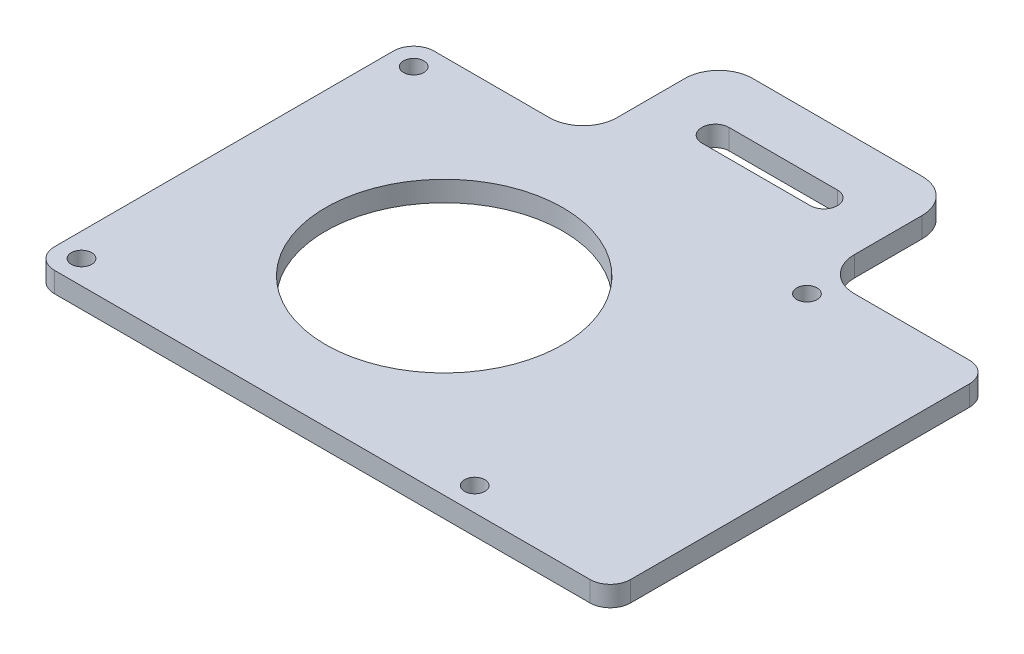
ISO-10303-21;
HEADER;
FILE_DESCRIPTION(('STEP AP214'),'2;1');
FILE_NAME('part.step','',(''),(''),'','','');
FILE_SCHEMA(('AUTOMOTIVE_DESIGN { 1 0 10303 214 1 1 1 1 }'));
ENDSEC;
DATA;
#1=APPLICATION_CONTEXT('core data for automotive mechanical design processes');
#2=APPLICATION_PROTOCOL_DEFINITION('international standard','automotive_design',2000,#1);
#3=PRODUCT_CONTEXT('',#1,'mechanical');
#4=PRODUCT('Part','Part','',(#3));
#5=PRODUCT_RELATED_PRODUCT_CATEGORY('part','',(#4));
#6=PRODUCT_DEFINITION_FORMATION('','',#4);
#7=PRODUCT_DEFINITION_CONTEXT('part definition',#1,'design');
#8=PRODUCT_DEFINITION('design','',#6,#7);
#9=PRODUCT_DEFINITION_SHAPE('','',#8);
#10=(LENGTH_UNIT() NAMED_UNIT(*) SI_UNIT(.MILLI.,.METRE.));
#11=(NAMED_UNIT(*) PLANE_ANGLE_UNIT() SI_UNIT($,.RADIAN.));
#12=(NAMED_UNIT(*) SI_UNIT($,.STERADIAN.) SOLID_ANGLE_UNIT());
#13=UNCERTAINTY_MEASURE_WITH_UNIT(LENGTH_MEASURE(1.E-05),#10,'distance_accuracy_value','');
#14=(GEOMETRIC_REPRESENTATION_CONTEXT(3) GLOBAL_UNCERTAINTY_ASSIGNED_CONTEXT((#13)) GLOBAL_UNIT_ASSIGNED_CONTEXT((#10,
#11,#12)) REPRESENTATION_CONTEXT('',''));
#15=CARTESIAN_POINT('',(0.,0.,0.));
#16=DIRECTION('',(0.,0.,1.));
#17=DIRECTION('',(1.,0.,0.));
#18=AXIS2_PLACEMENT_3D('',#15,#16,#17);
#19=CARTESIAN_POINT('',(-42.5,3.,-28.));
#20=DIRECTION('',(0.,0.,1.));
#21=DIRECTION('',(1.,0.,0.));
#22=AXIS2_PLACEMENT_3D('',#19,#20,#21);
#23=PLANE('',#22);
#24=DIRECTION('',(-1.,0.,0.));
#25=VECTOR('',#24,1.);
#26=CARTESIAN_POINT('',(-42.5,3.,-28.));
#27=LINE('',#26,#25);
#28=CARTESIAN_POINT('',(-22.5,3.,-28.));
#29=VERTEX_POINT('',#28);
#30=CARTESIAN_POINT('',(-39.5,3.,-28.));
#31=VERTEX_POINT('',#30);
#32=EDGE_CURVE('E271',#29,#31,#27,.T.);
#33=ORIENTED_EDGE('',*,*,#32,.F.);
#34=DIRECTION('',(0.,1.,0.));
#35=VECTOR('',#34,1.);
#36=CARTESIAN_POINT('',(-22.5,0.,-28.));
#37=LINE('',#36,#35);
#38=CARTESIAN_POINT('',(-22.5,0.,-28.));
#39=VERTEX_POINT('',#38);
#40=EDGE_CURVE('E205',#29,#39,#37,.F.);
#41=ORIENTED_EDGE('',*,*,#40,.T.);
#42=DIRECTION('',(-1.,0.,0.));
#43=VECTOR('',#42,1.);
#44=CARTESIAN_POINT('',(-42.5,0.,-28.));
#45=LINE('',#44,#43);
#46=CARTESIAN_POINT('',(-39.5,0.,-28.));
#47=VERTEX_POINT('',#46);
#48=EDGE_CURVE('E188',#39,#47,#45,.T.);
#49=ORIENTED_EDGE('',*,*,#48,.T.);
#50=DIRECTION('',(0.,-1.,0.));
#51=VECTOR('',#50,1.);
#52=CARTESIAN_POINT('',(-39.5,3.,-28.));
#53=LINE('',#52,#51);
#54=EDGE_CURVE('E316',#47,#31,#53,.F.);
#55=ORIENTED_EDGE('',*,*,#54,.T.);
#56=EDGE_LOOP('',(#33,#41,#49,#55));
#57=FACE_BOUND('',#56,.T.);
#58=ADVANCED_FACE('F35',(#57),#23,.F.);
#59=CARTESIAN_POINT('',(42.5,3.,28.));
#60=DIRECTION('',(-1.,0.,0.));
#61=DIRECTION('',(0.,0.,1.));
#62=AXIS2_PLACEMENT_3D('',#59,#60,#61);
#63=PLANE('',#62);
#64=DIRECTION('',(0.,0.,-1.));
#65=VECTOR('',#64,1.);
#66=CARTESIAN_POINT('',(42.5,3.,28.));
#67=LINE('',#66,#65);
#68=CARTESIAN_POINT('',(42.5,3.,25.));
#69=VERTEX_POINT('',#68);
#70=CARTESIAN_POINT('',(42.5,3.,-25.));
#71=VERTEX_POINT('',#70);
#72=EDGE_CURVE('E268',#69,#71,#67,.T.);
#73=ORIENTED_EDGE('',*,*,#72,.F.);
#74=DIRECTION('',(0.,-1.,0.));
#75=VECTOR('',#74,1.);
#76=CARTESIAN_POINT('',(42.5,3.,25.));
#77=LINE('',#76,#75);
#78=CARTESIAN_POINT('',(42.5,0.,25.));
#79=VERTEX_POINT('',#78);
#80=EDGE_CURVE('E294',#69,#79,#77,.T.);
#81=ORIENTED_EDGE('',*,*,#80,.T.);
#82=DIRECTION('',(0.,0.,-1.));
#83=VECTOR('',#82,1.);
#84=CARTESIAN_POINT('',(42.5,0.,28.));
#85=LINE('',#84,#83);
#86=CARTESIAN_POINT('',(42.5,0.,-25.));
#87=VERTEX_POINT('',#86);
#88=EDGE_CURVE('E267',#79,#87,#85,.T.);
#89=ORIENTED_EDGE('',*,*,#88,.T.);
#90=DIRECTION('',(0.,-1.,0.));
#91=VECTOR('',#90,1.);
#92=CARTESIAN_POINT('',(42.5,3.,-25.));
#93=LINE('',#92,#91);
#94=EDGE_CURVE('E282',#87,#71,#93,.F.);
#95=ORIENTED_EDGE('',*,*,#94,.T.);
#96=EDGE_LOOP('',(#73,#81,#89,#95));
#97=FACE_BOUND('',#96,.T.);
#98=ADVANCED_FACE('F393',(#97),#63,.F.);
#99=CARTESIAN_POINT('',(39.5,0.,-28.));
#100=VERTEX_POINT('',#99);
#101=CARTESIAN_POINT('',(22.5,0.,-28.));
#102=VERTEX_POINT('',#101);
#103=EDGE_CURVE('E285',#100,#102,#45,.T.);
#104=ORIENTED_EDGE('',*,*,#103,.T.);
#105=DIRECTION('',(0.,1.,0.));
#106=VECTOR('',#105,1.);
#107=CARTESIAN_POINT('',(22.5,3.,-28.));
#108=LINE('',#107,#106);
#109=CARTESIAN_POINT('',(22.5,3.,-28.));
#110=VERTEX_POINT('',#109);
#111=EDGE_CURVE('E327',#102,#110,#108,.T.);
#112=ORIENTED_EDGE('',*,*,#111,.T.);
#113=CARTESIAN_POINT('',(39.5,3.,-28.));
#114=VERTEX_POINT('',#113);
#115=EDGE_CURVE('E273',#114,#110,#27,.T.);
#116=ORIENTED_EDGE('',*,*,#115,.F.);
#117=DIRECTION('',(0.,-1.,0.));
#118=VECTOR('',#117,1.);
#119=CARTESIAN_POINT('',(39.5,3.,-28.));
#120=LINE('',#119,#118);
#121=EDGE_CURVE('E319',#114,#100,#120,.T.);
#122=ORIENTED_EDGE('',*,*,#121,.T.);
#123=EDGE_LOOP('',(#104,#112,#116,#122));
#124=FACE_BOUND('',#123,.T.);
#125=ADVANCED_FACE('F396',(#124),#23,.F.);
#126=CARTESIAN_POINT('',(-42.5,3.,28.));
#127=DIRECTION('',(1.,0.,0.));
#128=DIRECTION('',(0.,0.,-1.));
#129=AXIS2_PLACEMENT_3D('',#126,#127,#128);
#130=PLANE('',#129);
#131=DIRECTION('',(0.,0.,1.));
#132=VECTOR('',#131,1.);
#133=CARTESIAN_POINT('',(-42.5,0.,28.));
#134=LINE('',#133,#132);
#135=CARTESIAN_POINT('',(-42.5,0.,-25.));
#136=VERTEX_POINT('',#135);
#137=CARTESIAN_POINT('',(-42.5,0.,25.));
#138=VERTEX_POINT('',#137);
#139=EDGE_CURVE('E288',#136,#138,#134,.T.);
#140=ORIENTED_EDGE('',*,*,#139,.T.);
#141=DIRECTION('',(0.,-1.,0.));
#142=VECTOR('',#141,1.);
#143=CARTESIAN_POINT('',(-42.5,3.,25.));
#144=LINE('',#143,#142);
#145=CARTESIAN_POINT('',(-42.5,3.,25.));
#146=VERTEX_POINT('',#145);
#147=EDGE_CURVE('E325',#138,#146,#144,.F.);
#148=ORIENTED_EDGE('',*,*,#147,.T.);
#149=DIRECTION('',(0.,0.,1.));
#150=VECTOR('',#149,1.);
#151=CARTESIAN_POINT('',(-42.5,3.,28.));
#152=LINE('',#151,#150);
#153=CARTESIAN_POINT('',(-42.5,3.,-25.));
#154=VERTEX_POINT('',#153);
#155=EDGE_CURVE('E276',#154,#146,#152,.T.);
#156=ORIENTED_EDGE('',*,*,#155,.F.);
#157=DIRECTION('',(0.,-1.,0.));
#158=VECTOR('',#157,1.);
#159=CARTESIAN_POINT('',(-42.5,3.,-25.));
#160=LINE('',#159,#158);
#161=EDGE_CURVE('E322',#154,#136,#160,.T.);
#162=ORIENTED_EDGE('',*,*,#161,.T.);
#163=EDGE_LOOP('',(#140,#148,#156,#162));
#164=FACE_BOUND('',#163,.T.);
#165=ADVANCED_FACE('F405',(#164),#130,.F.);
#166=CARTESIAN_POINT('',(-42.5,3.,28.));
#167=DIRECTION('',(0.,0.,-1.));
#168=DIRECTION('',(-1.,0.,0.));
#169=AXIS2_PLACEMENT_3D('',#166,#167,#168);
#170=PLANE('',#169);
#171=DIRECTION('',(1.,0.,0.));
#172=VECTOR('',#171,1.);
#173=CARTESIAN_POINT('',(-42.5,0.,28.));
#174=LINE('',#173,#172);
#175=CARTESIAN_POINT('',(-39.5,0.,28.));
#176=VERTEX_POINT('',#175);
#177=CARTESIAN_POINT('',(39.5,0.,28.));
#178=VERTEX_POINT('',#177);
#179=EDGE_CURVE('E272',#176,#178,#174,.T.);
#180=ORIENTED_EDGE('',*,*,#179,.T.);
#181=DIRECTION('',(0.,-1.,0.));
#182=VECTOR('',#181,1.);
#183=CARTESIAN_POINT('',(39.5,3.,28.));
#184=LINE('',#183,#182);
#185=CARTESIAN_POINT('',(39.5,3.,28.));
#186=VERTEX_POINT('',#185);
#187=EDGE_CURVE('E306',#178,#186,#184,.F.);
#188=ORIENTED_EDGE('',*,*,#187,.T.);
#189=DIRECTION('',(1.,0.,0.));
#190=VECTOR('',#189,1.);
#191=CARTESIAN_POINT('',(-42.5,3.,28.));
#192=LINE('',#191,#190);
#193=CARTESIAN_POINT('',(-39.5,3.,28.));
#194=VERTEX_POINT('',#193);
#195=EDGE_CURVE('E279',#194,#186,#192,.T.);
#196=ORIENTED_EDGE('',*,*,#195,.F.);
#197=DIRECTION('',(0.,-1.,0.));
#198=VECTOR('',#197,1.);
#199=CARTESIAN_POINT('',(-39.5,3.,28.));
#200=LINE('',#199,#198);
#201=EDGE_CURVE('E303',#194,#176,#200,.T.);
#202=ORIENTED_EDGE('',*,*,#201,.T.);
#203=EDGE_LOOP('',(#180,#188,#196,#202));
#204=FACE_BOUND('',#203,.T.);
#205=ADVANCED_FACE('F410',(#204),#170,.F.);
#206=CARTESIAN_POINT('',(0.,3.,0.));
#207=DIRECTION('',(0.,-1.,0.));
#208=DIRECTION('',(0.,0.,-1.));
#209=AXIS2_PLACEMENT_3D('',#206,#207,#208);
#210=PLANE('',#209);
#211=DIRECTION('',(1.,0.,0.));
#212=VECTOR('',#211,1.);
#213=CARTESIAN_POINT('',(-8.,3.,-36.));
#214=LINE('',#213,#212);
#215=CARTESIAN_POINT('',(-8.,3.,-36.));
#216=VERTEX_POINT('',#215);
#217=CARTESIAN_POINT('',(8.,3.,-36.));
#218=VERTEX_POINT('',#217);
#219=EDGE_CURVE('E217',#216,#218,#214,.T.);
#220=ORIENTED_EDGE('',*,*,#219,.F.);
#221=CARTESIAN_POINT('',(-8.,3.,-38.));
#222=DIRECTION('',(0.,1.,0.));
#223=DIRECTION('',(0.,0.,1.));
#224=AXIS2_PLACEMENT_3D('',#221,#222,#223);
#225=CIRCLE('',#224,2.00000000000001);
#226=CARTESIAN_POINT('',(-8.,3.,-40.));
#227=VERTEX_POINT('',#226);
#228=EDGE_CURVE('E39',#227,#216,#225,.T.);
#229=ORIENTED_EDGE('',*,*,#228,.F.);
#230=DIRECTION('',(-1.,0.,0.));
#231=VECTOR('',#230,1.);
#232=CARTESIAN_POINT('',(-8.,3.,-40.));
#233=LINE('',#232,#231);
#234=CARTESIAN_POINT('',(8.,3.,-40.));
#235=VERTEX_POINT('',#234);
#236=EDGE_CURVE('E80',#235,#227,#233,.T.);
#237=ORIENTED_EDGE('',*,*,#236,.F.);
#238=CARTESIAN_POINT('',(8.,3.,-38.));
#239=DIRECTION('',(0.,1.,0.));
#240=DIRECTION('',(0.,0.,1.));
#241=AXIS2_PLACEMENT_3D('',#238,#239,#240);
#242=CIRCLE('',#241,2.00000000000001);
#243=EDGE_CURVE('E219',#218,#235,#242,.T.);
#244=ORIENTED_EDGE('',*,*,#243,.F.);
#245=EDGE_LOOP('',(#220,#229,#237,#244));
#246=FACE_BOUND('',#245,.T.);
#247=CARTESIAN_POINT('',(-9.99999999999999,3.,0.));
#248=DIRECTION('',(0.,-1.,0.));
#249=DIRECTION('',(0.,0.,-1.));
#250=AXIS2_PLACEMENT_3D('',#247,#248,#249);
#251=CIRCLE('',#250,17.5);
#252=CARTESIAN_POINT('',(-9.99999999999999,3.,-17.5));
#253=VERTEX_POINT('',#252);
#254=EDGE_CURVE('E240',#253,#253,#251,.T.);
#255=ORIENTED_EDGE('',*,*,#254,.T.);
#256=EDGE_LOOP('',(#255));
#257=FACE_BOUND('',#256,.T.);
#258=CARTESIAN_POINT('',(-39.,3.,24.5));
#259=DIRECTION('',(0.,-1.,0.));
#260=DIRECTION('',(0.,0.,-1.));
#261=AXIS2_PLACEMENT_3D('',#258,#259,#260);
#262=CIRCLE('',#261,1.5);
#263=CARTESIAN_POINT('',(-39.,3.,23.));
#264=VERTEX_POINT('',#263);
#265=EDGE_CURVE('E264',#264,#264,#262,.T.);
#266=ORIENTED_EDGE('',*,*,#265,.T.);
#267=EDGE_LOOP('',(#266));
#268=FACE_BOUND('',#267,.T.);
#269=CARTESIAN_POINT('',(19.,3.,24.5));
#270=DIRECTION('',(0.,-1.,0.));
#271=DIRECTION('',(0.,0.,-1.));
#272=AXIS2_PLACEMENT_3D('',#269,#270,#271);
#273=CIRCLE('',#272,1.5);
#274=CARTESIAN_POINT('',(19.,3.,23.));
#275=VERTEX_POINT('',#274);
#276=EDGE_CURVE('E261',#275,#275,#273,.T.);
#277=ORIENTED_EDGE('',*,*,#276,.T.);
#278=EDGE_LOOP('',(#277));
#279=FACE_BOUND('',#278,.T.);
#280=CARTESIAN_POINT('',(19.,3.,-24.5));
#281=DIRECTION('',(0.,-1.,0.));
#282=DIRECTION('',(0.,0.,-1.));
#283=AXIS2_PLACEMENT_3D('',#280,#281,#282);
#284=CIRCLE('',#283,1.5);
#285=CARTESIAN_POINT('',(19.,3.,-26.));
#286=VERTEX_POINT('',#285);
#287=EDGE_CURVE('E258',#286,#286,#284,.T.);
#288=ORIENTED_EDGE('',*,*,#287,.T.);
#289=EDGE_LOOP('',(#288));
#290=FACE_BOUND('',#289,.T.);
#291=CARTESIAN_POINT('',(-39.,3.,-24.5));
#292=DIRECTION('',(0.,-1.,0.));
#293=DIRECTION('',(0.,0.,-1.));
#294=AXIS2_PLACEMENT_3D('',#291,#292,#293);
#295=CIRCLE('',#294,1.5);
#296=CARTESIAN_POINT('',(-39.,3.,-26.));
#297=VERTEX_POINT('',#296);
#298=EDGE_CURVE('E255',#297,#297,#295,.T.);
#299=ORIENTED_EDGE('',*,*,#298,.T.);
#300=EDGE_LOOP('',(#299));
#301=FACE_BOUND('',#300,.T.);
#302=DIRECTION('',(0.,0.,-1.));
#303=VECTOR('',#302,1.);
#304=CARTESIAN_POINT('',(17.5,3.,-28.));
#305=LINE('',#304,#303);
#306=CARTESIAN_POINT('',(17.5,3.,-33.));
#307=VERTEX_POINT('',#306);
#308=CARTESIAN_POINT('',(17.5,3.,-43.));
#309=VERTEX_POINT('',#308);
#310=EDGE_CURVE('E201',#307,#309,#305,.T.);
#311=ORIENTED_EDGE('',*,*,#310,.T.);
#312=CARTESIAN_POINT('',(12.5,3.,-43.));
#313=DIRECTION('',(0.,-1.,0.));
#314=DIRECTION('',(0.,0.,-1.));
#315=AXIS2_PLACEMENT_3D('',#312,#313,#314);
#316=CIRCLE('',#315,5.);
#317=CARTESIAN_POINT('',(12.5,3.,-48.));
#318=VERTEX_POINT('',#317);
#319=EDGE_CURVE('E336',#309,#318,#316,.F.);
#320=ORIENTED_EDGE('',*,*,#319,.T.);
#321=DIRECTION('',(1.,0.,0.));
#322=VECTOR('',#321,1.);
#323=CARTESIAN_POINT('',(-17.5,3.,-48.));
#324=LINE('',#323,#322);
#325=CARTESIAN_POINT('',(-12.5,3.,-48.));
#326=VERTEX_POINT('',#325);
#327=EDGE_CURVE('E232',#326,#318,#324,.T.);
#328=ORIENTED_EDGE('',*,*,#327,.F.);
#329=CARTESIAN_POINT('',(-12.5,3.,-43.));
#330=DIRECTION('',(0.,-1.,0.));
#331=DIRECTION('',(0.,0.,-1.));
#332=AXIS2_PLACEMENT_3D('',#329,#330,#331);
#333=CIRCLE('',#332,5.);
#334=CARTESIAN_POINT('',(-17.5,3.,-43.));
#335=VERTEX_POINT('',#334);
#336=EDGE_CURVE('E334',#326,#335,#333,.F.);
#337=ORIENTED_EDGE('',*,*,#336,.T.);
#338=DIRECTION('',(0.,0.,-1.));
#339=VECTOR('',#338,1.);
#340=CARTESIAN_POINT('',(-17.5,3.,-28.));
#341=LINE('',#340,#339);
#342=CARTESIAN_POINT('',(-17.5,3.,-33.));
#343=VERTEX_POINT('',#342);
#344=EDGE_CURVE('E226',#343,#335,#341,.T.);
#345=ORIENTED_EDGE('',*,*,#344,.F.);
#346=CARTESIAN_POINT('',(-22.5,3.,-33.));
#347=DIRECTION('',(0.,-1.,0.));
#348=DIRECTION('',(0.,0.,-1.));
#349=AXIS2_PLACEMENT_3D('',#346,#347,#348);
#350=CIRCLE('',#349,5.);
#351=EDGE_CURVE('E44',#343,#29,#350,.T.);
#352=ORIENTED_EDGE('',*,*,#351,.T.);
#353=ORIENTED_EDGE('',*,*,#32,.T.);
#354=CARTESIAN_POINT('',(-39.5,3.,-25.));
#355=DIRECTION('',(0.,-1.,0.));
#356=DIRECTION('',(0.,0.,-1.));
#357=AXIS2_PLACEMENT_3D('',#354,#355,#356);
#358=CIRCLE('',#357,3.);
#359=EDGE_CURVE('E308',#31,#154,#358,.F.);
#360=ORIENTED_EDGE('',*,*,#359,.T.);
#361=ORIENTED_EDGE('',*,*,#155,.T.);
#362=CARTESIAN_POINT('',(-39.5,3.,25.));
#363=DIRECTION('',(0.,-1.,0.));
#364=DIRECTION('',(0.,0.,-1.));
#365=AXIS2_PLACEMENT_3D('',#362,#363,#364);
#366=CIRCLE('',#365,3.);
#367=EDGE_CURVE('E310',#146,#194,#366,.F.);
#368=ORIENTED_EDGE('',*,*,#367,.T.);
#369=ORIENTED_EDGE('',*,*,#195,.T.);
#370=CARTESIAN_POINT('',(39.5,3.,25.));
#371=DIRECTION('',(0.,-1.,0.));
#372=DIRECTION('',(0.,0.,-1.));
#373=AXIS2_PLACEMENT_3D('',#370,#371,#372);
#374=CIRCLE('',#373,3.);
#375=EDGE_CURVE('E314',#186,#69,#374,.F.);
#376=ORIENTED_EDGE('',*,*,#375,.T.);
#377=ORIENTED_EDGE('',*,*,#72,.T.);
#378=CARTESIAN_POINT('',(39.5,3.,-25.));
#379=DIRECTION('',(0.,-1.,0.));
#380=DIRECTION('',(0.,0.,-1.));
#381=AXIS2_PLACEMENT_3D('',#378,#379,#380);
#382=CIRCLE('',#381,3.);
#383=EDGE_CURVE('E312',#71,#114,#382,.F.);
#384=ORIENTED_EDGE('',*,*,#383,.T.);
#385=ORIENTED_EDGE('',*,*,#115,.T.);
#386=CARTESIAN_POINT('',(22.5,3.,-33.));
#387=DIRECTION('',(0.,-1.,0.));
#388=DIRECTION('',(0.,0.,-1.));
#389=AXIS2_PLACEMENT_3D('',#386,#387,#388);
#390=CIRCLE('',#389,5.);
#391=EDGE_CURVE('E212',#110,#307,#390,.T.);
#392=ORIENTED_EDGE('',*,*,#391,.T.);
#393=EDGE_LOOP('',(#311,#320,#328,#337,#345,#352,#353,#360,#361,#368,#369,#376,#377,#384,#385,#392));
#394=FACE_BOUND('',#393,.T.);
#395=ADVANCED_FACE('F354',(#246,#257,#268,#279,#290,#301,#394),#210,.F.);
#396=CARTESIAN_POINT('',(0.,0.,0.));
#397=DIRECTION('',(0.,-1.,0.));
#398=DIRECTION('',(0.,0.,-1.));
#399=AXIS2_PLACEMENT_3D('',#396,#397,#398);
#400=PLANE('',#399);
#401=CARTESIAN_POINT('',(-8.,0.,-38.));
#402=DIRECTION('',(0.,1.,0.));
#403=DIRECTION('',(0.,0.,1.));
#404=AXIS2_PLACEMENT_3D('',#401,#402,#403);
#405=CIRCLE('',#404,2.00000000000001);
#406=CARTESIAN_POINT('',(-8.,0.,-40.));
#407=VERTEX_POINT('',#406);
#408=CARTESIAN_POINT('',(-8.,0.,-36.));
#409=VERTEX_POINT('',#408);
#410=EDGE_CURVE('E370',#407,#409,#405,.T.);
#411=ORIENTED_EDGE('',*,*,#410,.T.);
#412=DIRECTION('',(1.,0.,0.));
#413=VECTOR('',#412,1.);
#414=CARTESIAN_POINT('',(-8.,0.,-36.));
#415=LINE('',#414,#413);
#416=CARTESIAN_POINT('',(8.,0.,-36.));
#417=VERTEX_POINT('',#416);
#418=EDGE_CURVE('E367',#409,#417,#415,.T.);
#419=ORIENTED_EDGE('',*,*,#418,.T.);
#420=CARTESIAN_POINT('',(8.,0.,-38.));
#421=DIRECTION('',(0.,1.,0.));
#422=DIRECTION('',(0.,0.,1.));
#423=AXIS2_PLACEMENT_3D('',#420,#421,#422);
#424=CIRCLE('',#423,2.00000000000001);
#425=CARTESIAN_POINT('',(8.,0.,-40.));
#426=VERTEX_POINT('',#425);
#427=EDGE_CURVE('E61',#417,#426,#424,.T.);
#428=ORIENTED_EDGE('',*,*,#427,.T.);
#429=DIRECTION('',(-1.,0.,0.));
#430=VECTOR('',#429,1.);
#431=CARTESIAN_POINT('',(-8.,0.,-40.));
#432=LINE('',#431,#430);
#433=EDGE_CURVE('E361',#426,#407,#432,.T.);
#434=ORIENTED_EDGE('',*,*,#433,.T.);
#435=EDGE_LOOP('',(#411,#419,#428,#434));
#436=FACE_BOUND('',#435,.T.);
#437=CARTESIAN_POINT('',(-9.99999999999999,0.,0.));
#438=DIRECTION('',(0.,1.,0.));
#439=DIRECTION('',(0.,0.,1.));
#440=AXIS2_PLACEMENT_3D('',#437,#438,#439);
#441=CIRCLE('',#440,17.5);
#442=CARTESIAN_POINT('',(-9.99999999999999,0.,17.5));
#443=VERTEX_POINT('',#442);
#444=EDGE_CURVE('E237',#443,#443,#441,.T.);
#445=ORIENTED_EDGE('',*,*,#444,.T.);
#446=EDGE_LOOP('',(#445));
#447=FACE_BOUND('',#446,.T.);
#448=CARTESIAN_POINT('',(-39.,0.,24.5));
#449=DIRECTION('',(0.,1.,0.));
#450=DIRECTION('',(0.,0.,1.));
#451=AXIS2_PLACEMENT_3D('',#448,#449,#450);
#452=CIRCLE('',#451,1.5);
#453=CARTESIAN_POINT('',(-39.,0.,26.));
#454=VERTEX_POINT('',#453);
#455=EDGE_CURVE('E243',#454,#454,#452,.T.);
#456=ORIENTED_EDGE('',*,*,#455,.T.);
#457=EDGE_LOOP('',(#456));
#458=FACE_BOUND('',#457,.T.);
#459=CARTESIAN_POINT('',(19.,0.,24.5));
#460=DIRECTION('',(0.,1.,0.));
#461=DIRECTION('',(0.,0.,1.));
#462=AXIS2_PLACEMENT_3D('',#459,#460,#461);
#463=CIRCLE('',#462,1.5);
#464=CARTESIAN_POINT('',(19.,0.,26.));
#465=VERTEX_POINT('',#464);
#466=EDGE_CURVE('E248',#465,#465,#463,.T.);
#467=ORIENTED_EDGE('',*,*,#466,.T.);
#468=EDGE_LOOP('',(#467));
#469=FACE_BOUND('',#468,.T.);
#470=CARTESIAN_POINT('',(19.,0.,-24.5));
#471=DIRECTION('',(0.,1.,0.));
#472=DIRECTION('',(0.,0.,1.));
#473=AXIS2_PLACEMENT_3D('',#470,#471,#472);
#474=CIRCLE('',#473,1.5);
#475=CARTESIAN_POINT('',(19.,0.,-23.));
#476=VERTEX_POINT('',#475);
#477=EDGE_CURVE('E244',#476,#476,#474,.T.);
#478=ORIENTED_EDGE('',*,*,#477,.T.);
#479=EDGE_LOOP('',(#478));
#480=FACE_BOUND('',#479,.T.);
#481=CARTESIAN_POINT('',(-39.,0.,-24.5));
#482=DIRECTION('',(0.,1.,0.));
#483=DIRECTION('',(0.,0.,1.));
#484=AXIS2_PLACEMENT_3D('',#481,#482,#483);
#485=CIRCLE('',#484,1.5);
#486=CARTESIAN_POINT('',(-39.,0.,-23.));
#487=VERTEX_POINT('',#486);
#488=EDGE_CURVE('E247',#487,#487,#485,.T.);
#489=ORIENTED_EDGE('',*,*,#488,.T.);
#490=EDGE_LOOP('',(#489));
#491=FACE_BOUND('',#490,.T.);
#492=DIRECTION('',(1.,0.,0.));
#493=VECTOR('',#492,1.);
#494=CARTESIAN_POINT('',(-17.5,0.,-48.));
#495=LINE('',#494,#493);
#496=CARTESIAN_POINT('',(-12.5,0.,-48.));
#497=VERTEX_POINT('',#496);
#498=CARTESIAN_POINT('',(12.5,0.,-48.));
#499=VERTEX_POINT('',#498);
#500=EDGE_CURVE('E200',#497,#499,#495,.T.);
#501=ORIENTED_EDGE('',*,*,#500,.T.);
#502=CARTESIAN_POINT('',(12.5,0.,-43.));
#503=DIRECTION('',(0.,-1.,0.));
#504=DIRECTION('',(0.,0.,-1.));
#505=AXIS2_PLACEMENT_3D('',#502,#503,#504);
#506=CIRCLE('',#505,5.);
#507=CARTESIAN_POINT('',(17.5,0.,-43.));
#508=VERTEX_POINT('',#507);
#509=EDGE_CURVE('E203',#499,#508,#506,.T.);
#510=ORIENTED_EDGE('',*,*,#509,.T.);
#511=DIRECTION('',(0.,0.,-1.));
#512=VECTOR('',#511,1.);
#513=CARTESIAN_POINT('',(17.5,0.,-28.));
#514=LINE('',#513,#512);
#515=CARTESIAN_POINT('',(17.5,0.,-33.));
#516=VERTEX_POINT('',#515);
#517=EDGE_CURVE('E221',#516,#508,#514,.T.);
#518=ORIENTED_EDGE('',*,*,#517,.F.);
#519=CARTESIAN_POINT('',(22.5,0.,-33.));
#520=DIRECTION('',(0.,-1.,0.));
#521=DIRECTION('',(0.,0.,-1.));
#522=AXIS2_PLACEMENT_3D('',#519,#520,#521);
#523=CIRCLE('',#522,5.);
#524=EDGE_CURVE('E214',#516,#102,#523,.F.);
#525=ORIENTED_EDGE('',*,*,#524,.T.);
#526=ORIENTED_EDGE('',*,*,#103,.F.);
#527=CARTESIAN_POINT('',(39.5,0.,-25.));
#528=DIRECTION('',(0.,-1.,0.));
#529=DIRECTION('',(0.,0.,-1.));
#530=AXIS2_PLACEMENT_3D('',#527,#528,#529);
#531=CIRCLE('',#530,3.);
#532=EDGE_CURVE('E300',#100,#87,#531,.T.);
#533=ORIENTED_EDGE('',*,*,#532,.T.);
#534=ORIENTED_EDGE('',*,*,#88,.F.);
#535=CARTESIAN_POINT('',(39.5,0.,25.));
#536=DIRECTION('',(0.,-1.,0.));
#537=DIRECTION('',(0.,0.,-1.));
#538=AXIS2_PLACEMENT_3D('',#535,#536,#537);
#539=CIRCLE('',#538,3.);
#540=EDGE_CURVE('E89',#79,#178,#539,.T.);
#541=ORIENTED_EDGE('',*,*,#540,.T.);
#542=ORIENTED_EDGE('',*,*,#179,.F.);
#543=CARTESIAN_POINT('',(-39.5,0.,25.));
#544=DIRECTION('',(0.,-1.,0.));
#545=DIRECTION('',(0.,0.,-1.));
#546=AXIS2_PLACEMENT_3D('',#543,#544,#545);
#547=CIRCLE('',#546,3.);
#548=EDGE_CURVE('E298',#176,#138,#547,.T.);
#549=ORIENTED_EDGE('',*,*,#548,.T.);
#550=ORIENTED_EDGE('',*,*,#139,.F.);
#551=CARTESIAN_POINT('',(-39.5,0.,-25.));
#552=DIRECTION('',(0.,-1.,0.));
#553=DIRECTION('',(0.,0.,-1.));
#554=AXIS2_PLACEMENT_3D('',#551,#552,#553);
#555=CIRCLE('',#554,3.);
#556=EDGE_CURVE('E296',#136,#47,#555,.T.);
#557=ORIENTED_EDGE('',*,*,#556,.T.);
#558=ORIENTED_EDGE('',*,*,#48,.F.);
#559=CARTESIAN_POINT('',(-22.5,0.,-33.));
#560=DIRECTION('',(0.,-1.,0.));
#561=DIRECTION('',(0.,0.,-1.));
#562=AXIS2_PLACEMENT_3D('',#559,#560,#561);
#563=CIRCLE('',#562,5.);
#564=CARTESIAN_POINT('',(-17.5,0.,-33.));
#565=VERTEX_POINT('',#564);
#566=EDGE_CURVE('E11',#39,#565,#563,.F.);
#567=ORIENTED_EDGE('',*,*,#566,.T.);
#568=DIRECTION('',(0.,0.,-1.));
#569=VECTOR('',#568,1.);
#570=CARTESIAN_POINT('',(-17.5,0.,-28.));
#571=LINE('',#570,#569);
#572=CARTESIAN_POINT('',(-17.5,0.,-43.));
#573=VERTEX_POINT('',#572);
#574=EDGE_CURVE('E185',#565,#573,#571,.T.);
#575=ORIENTED_EDGE('',*,*,#574,.T.);
#576=CARTESIAN_POINT('',(-12.5,0.,-43.));
#577=DIRECTION('',(0.,-1.,0.));
#578=DIRECTION('',(0.,0.,-1.));
#579=AXIS2_PLACEMENT_3D('',#576,#577,#578);
#580=CIRCLE('',#579,5.);
#581=EDGE_CURVE('E207',#573,#497,#580,.T.);
#582=ORIENTED_EDGE('',*,*,#581,.T.);
#583=EDGE_LOOP('',(#501,#510,#518,#525,#526,#533,#534,#541,#542,#549,#550,#557,#558,#567,#575,#582));
#584=FACE_BOUND('',#583,.T.);
#585=ADVANCED_FACE('F184',(#436,#447,#458,#469,#480,#491,#584),#400,.T.);
#586=CARTESIAN_POINT('',(-39.,0.,-24.5));
#587=DIRECTION('',(0.,1.,0.));
#588=DIRECTION('',(0.,0.,1.));
#589=AXIS2_PLACEMENT_3D('',#586,#587,#588);
#590=CYLINDRICAL_SURFACE('',#589,1.5);
#591=ORIENTED_EDGE('',*,*,#488,.F.);
#592=EDGE_LOOP('',(#591));
#593=FACE_BOUND('',#592,.T.);
#594=ORIENTED_EDGE('',*,*,#298,.F.);
#595=EDGE_LOOP('',(#594));
#596=FACE_BOUND('',#595,.T.);
#597=ADVANCED_FACE('F479',(#593,#596),#590,.F.);
#598=CARTESIAN_POINT('',(19.,0.,-24.5));
#599=DIRECTION('',(0.,1.,0.));
#600=DIRECTION('',(0.,0.,1.));
#601=AXIS2_PLACEMENT_3D('',#598,#599,#600);
#602=CYLINDRICAL_SURFACE('',#601,1.5);
#603=ORIENTED_EDGE('',*,*,#477,.F.);
#604=EDGE_LOOP('',(#603));
#605=FACE_BOUND('',#604,.T.);
#606=ORIENTED_EDGE('',*,*,#287,.F.);
#607=EDGE_LOOP('',(#606));
#608=FACE_BOUND('',#607,.T.);
#609=ADVANCED_FACE('F482',(#605,#608),#602,.F.);
#610=CARTESIAN_POINT('',(19.,0.,24.5));
#611=DIRECTION('',(0.,1.,0.));
#612=DIRECTION('',(0.,0.,1.));
#613=AXIS2_PLACEMENT_3D('',#610,#611,#612);
#614=CYLINDRICAL_SURFACE('',#613,1.5);
#615=ORIENTED_EDGE('',*,*,#466,.F.);
#616=EDGE_LOOP('',(#615));
#617=FACE_BOUND('',#616,.T.);
#618=ORIENTED_EDGE('',*,*,#276,.F.);
#619=EDGE_LOOP('',(#618));
#620=FACE_BOUND('',#619,.T.);
#621=ADVANCED_FACE('F451',(#617,#620),#614,.F.);
#622=CARTESIAN_POINT('',(-39.,0.,24.5));
#623=DIRECTION('',(0.,1.,0.));
#624=DIRECTION('',(0.,0.,1.));
#625=AXIS2_PLACEMENT_3D('',#622,#623,#624);
#626=CYLINDRICAL_SURFACE('',#625,1.5);
#627=ORIENTED_EDGE('',*,*,#455,.F.);
#628=EDGE_LOOP('',(#627));
#629=FACE_BOUND('',#628,.T.);
#630=ORIENTED_EDGE('',*,*,#265,.F.);
#631=EDGE_LOOP('',(#630));
#632=FACE_BOUND('',#631,.T.);
#633=ADVANCED_FACE('F447',(#629,#632),#626,.F.);
#634=CARTESIAN_POINT('',(39.5,3.,25.));
#635=DIRECTION('',(0.,-1.,0.));
#636=DIRECTION('',(0.,0.,-1.));
#637=AXIS2_PLACEMENT_3D('',#634,#635,#636);
#638=CYLINDRICAL_SURFACE('',#637,3.);
#639=ORIENTED_EDGE('',*,*,#375,.F.);
#640=ORIENTED_EDGE('',*,*,#187,.F.);
#641=ORIENTED_EDGE('',*,*,#540,.F.);
#642=ORIENTED_EDGE('',*,*,#80,.F.);
#643=EDGE_LOOP('',(#639,#640,#641,#642));
#644=FACE_BOUND('',#643,.T.);
#645=ADVANCED_FACE('F444',(#644),#638,.T.);
#646=CARTESIAN_POINT('',(39.5,3.,-25.));
#647=DIRECTION('',(0.,-1.,0.));
#648=DIRECTION('',(0.,0.,-1.));
#649=AXIS2_PLACEMENT_3D('',#646,#647,#648);
#650=CYLINDRICAL_SURFACE('',#649,3.);
#651=ORIENTED_EDGE('',*,*,#383,.F.);
#652=ORIENTED_EDGE('',*,*,#94,.F.);
#653=ORIENTED_EDGE('',*,*,#532,.F.);
#654=ORIENTED_EDGE('',*,*,#121,.F.);
#655=EDGE_LOOP('',(#651,#652,#653,#654));
#656=FACE_BOUND('',#655,.T.);
#657=ADVANCED_FACE('F440',(#656),#650,.T.);
#658=CARTESIAN_POINT('',(-39.5,3.,25.));
#659=DIRECTION('',(0.,-1.,0.));
#660=DIRECTION('',(0.,0.,-1.));
#661=AXIS2_PLACEMENT_3D('',#658,#659,#660);
#662=CYLINDRICAL_SURFACE('',#661,3.);
#663=ORIENTED_EDGE('',*,*,#367,.F.);
#664=ORIENTED_EDGE('',*,*,#147,.F.);
#665=ORIENTED_EDGE('',*,*,#548,.F.);
#666=ORIENTED_EDGE('',*,*,#201,.F.);
#667=EDGE_LOOP('',(#663,#664,#665,#666));
#668=FACE_BOUND('',#667,.T.);
#669=ADVANCED_FACE('F436',(#668),#662,.T.);
#670=CARTESIAN_POINT('',(-39.5,3.,-25.));
#671=DIRECTION('',(0.,-1.,0.));
#672=DIRECTION('',(0.,0.,-1.));
#673=AXIS2_PLACEMENT_3D('',#670,#671,#672);
#674=CYLINDRICAL_SURFACE('',#673,3.);
#675=ORIENTED_EDGE('',*,*,#359,.F.);
#676=ORIENTED_EDGE('',*,*,#54,.F.);
#677=ORIENTED_EDGE('',*,*,#556,.F.);
#678=ORIENTED_EDGE('',*,*,#161,.F.);
#679=EDGE_LOOP('',(#675,#676,#677,#678));
#680=FACE_BOUND('',#679,.T.);
#681=ADVANCED_FACE('F432',(#680),#674,.T.);
#682=CARTESIAN_POINT('',(-9.99999999999999,0.,0.));
#683=DIRECTION('',(0.,1.,0.));
#684=DIRECTION('',(0.,0.,1.));
#685=AXIS2_PLACEMENT_3D('',#682,#683,#684);
#686=CYLINDRICAL_SURFACE('',#685,17.5);
#687=ORIENTED_EDGE('',*,*,#444,.F.);
#688=EDGE_LOOP('',(#687));
#689=FACE_BOUND('',#688,.T.);
#690=ORIENTED_EDGE('',*,*,#254,.F.);
#691=EDGE_LOOP('',(#690));
#692=FACE_BOUND('',#691,.T.);
#693=ADVANCED_FACE('F435',(#689,#692),#686,.F.);
#694=CARTESIAN_POINT('',(17.5,-40.3112887414928,-28.));
#695=DIRECTION('',(1.,0.,0.));
#696=DIRECTION('',(0.,0.,-1.));
#697=AXIS2_PLACEMENT_3D('',#694,#695,#696);
#698=PLANE('',#697);
#699=ORIENTED_EDGE('',*,*,#310,.F.);
#700=DIRECTION('',(0.,1.,0.));
#701=VECTOR('',#700,1.);
#702=CARTESIAN_POINT('',(17.5,-40.3112887414928,-33.));
#703=LINE('',#702,#701);
#704=EDGE_CURVE('E332',#307,#516,#703,.F.);
#705=ORIENTED_EDGE('',*,*,#704,.T.);
#706=ORIENTED_EDGE('',*,*,#517,.T.);
#707=DIRECTION('',(0.,1.,0.));
#708=VECTOR('',#707,1.);
#709=CARTESIAN_POINT('',(17.5,3.,-43.));
#710=LINE('',#709,#708);
#711=EDGE_CURVE('E330',#508,#309,#710,.T.);
#712=ORIENTED_EDGE('',*,*,#711,.T.);
#713=EDGE_LOOP('',(#699,#705,#706,#712));
#714=FACE_BOUND('',#713,.T.);
#715=ADVANCED_FACE('F421',(#714),#698,.T.);
#716=CARTESIAN_POINT('',(-17.5,-40.3112887414928,-28.));
#717=DIRECTION('',(1.,0.,0.));
#718=DIRECTION('',(0.,0.,-1.));
#719=AXIS2_PLACEMENT_3D('',#716,#717,#718);
#720=PLANE('',#719);
#721=ORIENTED_EDGE('',*,*,#344,.T.);
#722=DIRECTION('',(0.,1.,0.));
#723=VECTOR('',#722,1.);
#724=CARTESIAN_POINT('',(-17.5,-40.3112887414928,-43.));
#725=LINE('',#724,#723);
#726=EDGE_CURVE('E199',#335,#573,#725,.F.);
#727=ORIENTED_EDGE('',*,*,#726,.T.);
#728=ORIENTED_EDGE('',*,*,#574,.F.);
#729=DIRECTION('',(0.,1.,0.));
#730=VECTOR('',#729,1.);
#731=CARTESIAN_POINT('',(-17.5,3.,-33.));
#732=LINE('',#731,#730);
#733=EDGE_CURVE('E196',#565,#343,#732,.T.);
#734=ORIENTED_EDGE('',*,*,#733,.T.);
#735=EDGE_LOOP('',(#721,#727,#728,#734));
#736=FACE_BOUND('',#735,.T.);
#737=ADVANCED_FACE('F195',(#736),#720,.F.);
#738=CARTESIAN_POINT('',(-17.5,-40.3112887414928,-48.));
#739=DIRECTION('',(0.,0.,1.));
#740=DIRECTION('',(1.,0.,0.));
#741=AXIS2_PLACEMENT_3D('',#738,#739,#740);
#742=PLANE('',#741);
#743=ORIENTED_EDGE('',*,*,#327,.T.);
#744=DIRECTION('',(0.,1.,0.));
#745=VECTOR('',#744,1.);
#746=CARTESIAN_POINT('',(12.5,0.,-48.));
#747=LINE('',#746,#745);
#748=EDGE_CURVE('E341',#318,#499,#747,.F.);
#749=ORIENTED_EDGE('',*,*,#748,.T.);
#750=ORIENTED_EDGE('',*,*,#500,.F.);
#751=DIRECTION('',(0.,1.,0.));
#752=VECTOR('',#751,1.);
#753=CARTESIAN_POINT('',(-12.5,-40.3112887414928,-48.));
#754=LINE('',#753,#752);
#755=EDGE_CURVE('E338',#497,#326,#754,.T.);
#756=ORIENTED_EDGE('',*,*,#755,.T.);
#757=EDGE_LOOP('',(#743,#749,#750,#756));
#758=FACE_BOUND('',#757,.T.);
#759=ADVANCED_FACE('F348',(#758),#742,.F.);
#760=CARTESIAN_POINT('',(22.5,3.,-33.));
#761=DIRECTION('',(0.,1.,0.));
#762=DIRECTION('',(0.,0.,1.));
#763=AXIS2_PLACEMENT_3D('',#760,#761,#762);
#764=CYLINDRICAL_SURFACE('',#763,5.);
#765=ORIENTED_EDGE('',*,*,#524,.F.);
#766=ORIENTED_EDGE('',*,*,#704,.F.);
#767=ORIENTED_EDGE('',*,*,#391,.F.);
#768=ORIENTED_EDGE('',*,*,#111,.F.);
#769=EDGE_LOOP('',(#765,#766,#767,#768));
#770=FACE_BOUND('',#769,.T.);
#771=ADVANCED_FACE('F418',(#770),#764,.F.);
#772=CARTESIAN_POINT('',(12.5,-40.3112887414928,-43.));
#773=DIRECTION('',(0.,-1.,0.));
#774=DIRECTION('',(0.,0.,-1.));
#775=AXIS2_PLACEMENT_3D('',#772,#773,#774);
#776=CYLINDRICAL_SURFACE('',#775,5.);
#777=ORIENTED_EDGE('',*,*,#509,.F.);
#778=ORIENTED_EDGE('',*,*,#748,.F.);
#779=ORIENTED_EDGE('',*,*,#319,.F.);
#780=ORIENTED_EDGE('',*,*,#711,.F.);
#781=EDGE_LOOP('',(#777,#778,#779,#780));
#782=FACE_BOUND('',#781,.T.);
#783=ADVANCED_FACE('F423',(#782),#776,.T.);
#784=CARTESIAN_POINT('',(-12.5,-40.3112887414928,-43.));
#785=DIRECTION('',(0.,1.,0.));
#786=DIRECTION('',(0.,0.,1.));
#787=AXIS2_PLACEMENT_3D('',#784,#785,#786);
#788=CYLINDRICAL_SURFACE('',#787,5.);
#789=ORIENTED_EDGE('',*,*,#581,.F.);
#790=ORIENTED_EDGE('',*,*,#726,.F.);
#791=ORIENTED_EDGE('',*,*,#336,.F.);
#792=ORIENTED_EDGE('',*,*,#755,.F.);
#793=EDGE_LOOP('',(#789,#790,#791,#792));
#794=FACE_BOUND('',#793,.T.);
#795=ADVANCED_FACE('F351',(#794),#788,.T.);
#796=CARTESIAN_POINT('',(-22.5,-40.3112887414928,-33.));
#797=DIRECTION('',(0.,-1.,0.));
#798=DIRECTION('',(0.,0.,-1.));
#799=AXIS2_PLACEMENT_3D('',#796,#797,#798);
#800=CYLINDRICAL_SURFACE('',#799,5.);
#801=ORIENTED_EDGE('',*,*,#566,.F.);
#802=ORIENTED_EDGE('',*,*,#40,.F.);
#803=ORIENTED_EDGE('',*,*,#351,.F.);
#804=ORIENTED_EDGE('',*,*,#733,.F.);
#805=EDGE_LOOP('',(#801,#802,#803,#804));
#806=FACE_BOUND('',#805,.T.);
#807=ADVANCED_FACE('F37',(#806),#800,.F.);
#808=CARTESIAN_POINT('',(-8.,0.,-38.));
#809=DIRECTION('',(0.,1.,0.));
#810=DIRECTION('',(0.,0.,1.));
#811=AXIS2_PLACEMENT_3D('',#808,#809,#810);
#812=CYLINDRICAL_SURFACE('',#811,2.00000000000001);
#813=DIRECTION('',(0.,1.,0.));
#814=VECTOR('',#813,1.);
#815=CARTESIAN_POINT('',(-8.,0.,-36.));
#816=LINE('',#815,#814);
#817=EDGE_CURVE('E52',#409,#216,#816,.T.);
#818=ORIENTED_EDGE('',*,*,#817,.F.);
#819=ORIENTED_EDGE('',*,*,#410,.F.);
#820=DIRECTION('',(0.,1.,0.));
#821=VECTOR('',#820,1.);
#822=CARTESIAN_POINT('',(-8.,0.,-40.));
#823=LINE('',#822,#821);
#824=EDGE_CURVE('E220',#407,#227,#823,.T.);
#825=ORIENTED_EDGE('',*,*,#824,.T.);
#826=ORIENTED_EDGE('',*,*,#228,.T.);
#827=EDGE_LOOP('',(#818,#819,#825,#826));
#828=FACE_BOUND('',#827,.T.);
#829=ADVANCED_FACE('F379',(#828),#812,.F.);
#830=CARTESIAN_POINT('',(-8.,0.,-40.));
#831=DIRECTION('',(0.,0.,-1.));
#832=DIRECTION('',(-1.,0.,0.));
#833=AXIS2_PLACEMENT_3D('',#830,#831,#832);
#834=PLANE('',#833);
#835=ORIENTED_EDGE('',*,*,#824,.F.);
#836=ORIENTED_EDGE('',*,*,#433,.F.);
#837=DIRECTION('',(0.,1.,0.));
#838=VECTOR('',#837,1.);
#839=CARTESIAN_POINT('',(8.,0.,-40.));
#840=LINE('',#839,#838);
#841=EDGE_CURVE('E359',#426,#235,#840,.T.);
#842=ORIENTED_EDGE('',*,*,#841,.T.);
#843=ORIENTED_EDGE('',*,*,#236,.T.);
#844=EDGE_LOOP('',(#835,#836,#842,#843));
#845=FACE_BOUND('',#844,.T.);
#846=ADVANCED_FACE('F382',(#845),#834,.F.);
#847=CARTESIAN_POINT('',(8.,0.,-38.));
#848=DIRECTION('',(0.,1.,0.));
#849=DIRECTION('',(0.,0.,1.));
#850=AXIS2_PLACEMENT_3D('',#847,#848,#849);
#851=CYLINDRICAL_SURFACE('',#850,2.00000000000001);
#852=ORIENTED_EDGE('',*,*,#841,.F.);
#853=ORIENTED_EDGE('',*,*,#427,.F.);
#854=DIRECTION('',(0.,1.,0.));
#855=VECTOR('',#854,1.);
#856=CARTESIAN_POINT('',(8.,0.,-36.));
#857=LINE('',#856,#855);
#858=EDGE_CURVE('E357',#417,#218,#857,.T.);
#859=ORIENTED_EDGE('',*,*,#858,.T.);
#860=ORIENTED_EDGE('',*,*,#243,.T.);
#861=EDGE_LOOP('',(#852,#853,#859,#860));
#862=FACE_BOUND('',#861,.T.);
#863=ADVANCED_FACE('F380',(#862),#851,.F.);
#864=CARTESIAN_POINT('',(-8.,0.,-36.));
#865=DIRECTION('',(0.,0.,1.));
#866=DIRECTION('',(1.,0.,0.));
#867=AXIS2_PLACEMENT_3D('',#864,#865,#866);
#868=PLANE('',#867);
#869=ORIENTED_EDGE('',*,*,#858,.F.);
#870=ORIENTED_EDGE('',*,*,#418,.F.);
#871=ORIENTED_EDGE('',*,*,#817,.T.);
#872=ORIENTED_EDGE('',*,*,#219,.T.);
#873=EDGE_LOOP('',(#869,#870,#871,#872));
#874=FACE_BOUND('',#873,.T.);
#875=ADVANCED_FACE('F389',(#874),#868,.F.);
#876=CLOSED_SHELL('',(#58,#98,#125,#165,#205,#395,#585,#597,#609,#621,#633,#645,#657,#669,#681,
#693,#715,#737,#759,#771,#783,#795,#807,#829,#846,#863,#875));
#877=MANIFOLD_SOLID_BREP('B2',#876);
#878=ADVANCED_BREP_SHAPE_REPRESENTATION('',(#18,#877),#14);
#879=SHAPE_DEFINITION_REPRESENTATION(#9,#878);
ENDSEC;
END-ISO-10303-21;
